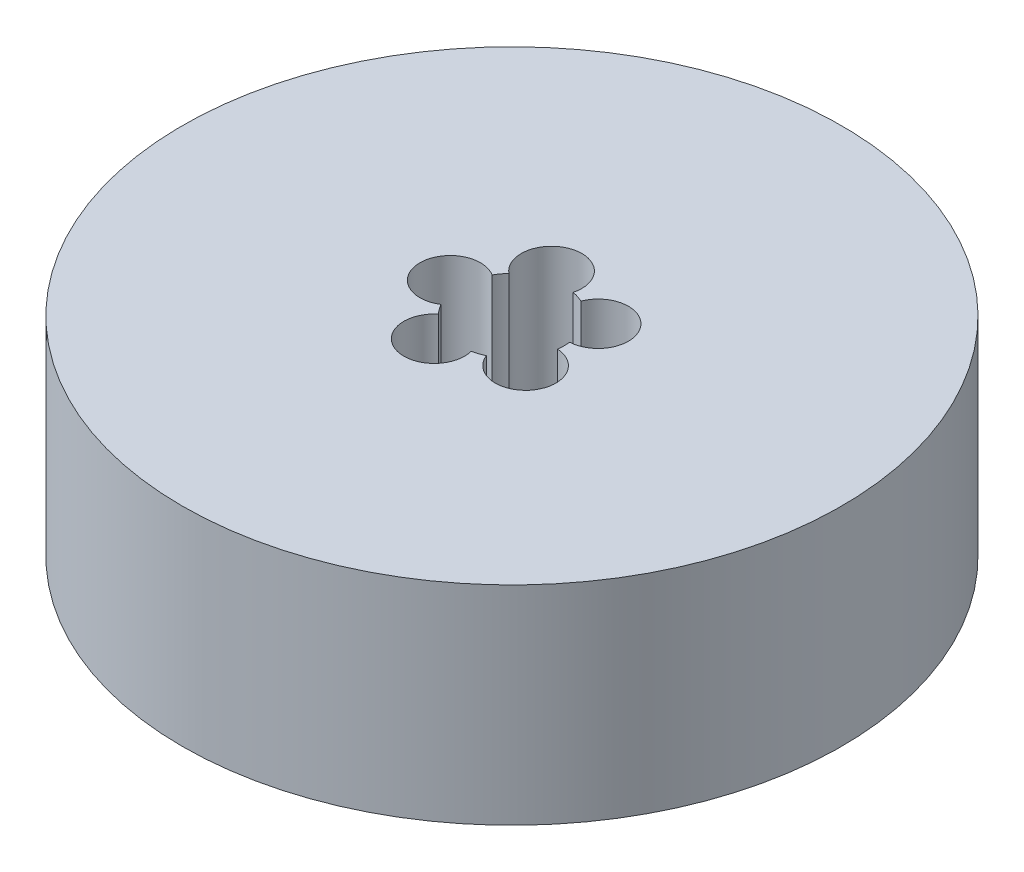
ISO-10303-21;
HEADER;
FILE_DESCRIPTION(('STEP AP214'),'2;1');
FILE_NAME('part.step','',(''),(''),'','','');
FILE_SCHEMA(('AUTOMOTIVE_DESIGN { 1 0 10303 214 1 1 1 1 }'));
ENDSEC;
DATA;
#1=APPLICATION_CONTEXT('core data for automotive mechanical design processes');
#2=APPLICATION_PROTOCOL_DEFINITION('international standard','automotive_design',2000,#1);
#3=PRODUCT_CONTEXT('',#1,'mechanical');
#4=PRODUCT('Part','Part','',(#3));
#5=PRODUCT_RELATED_PRODUCT_CATEGORY('part','',(#4));
#6=PRODUCT_DEFINITION_FORMATION('','',#4);
#7=PRODUCT_DEFINITION_CONTEXT('part definition',#1,'design');
#8=PRODUCT_DEFINITION('design','',#6,#7);
#9=PRODUCT_DEFINITION_SHAPE('','',#8);
#10=(LENGTH_UNIT() NAMED_UNIT(*) SI_UNIT(.MILLI.,.METRE.));
#11=(NAMED_UNIT(*) PLANE_ANGLE_UNIT() SI_UNIT($,.RADIAN.));
#12=(NAMED_UNIT(*) SI_UNIT($,.STERADIAN.) SOLID_ANGLE_UNIT());
#13=UNCERTAINTY_MEASURE_WITH_UNIT(LENGTH_MEASURE(1.E-05),#10,'distance_accuracy_value','');
#14=(GEOMETRIC_REPRESENTATION_CONTEXT(3) GLOBAL_UNCERTAINTY_ASSIGNED_CONTEXT((#13)) GLOBAL_UNIT_ASSIGNED_CONTEXT((#10,
#11,#12)) REPRESENTATION_CONTEXT('',''));
#15=CARTESIAN_POINT('',(0.,0.,0.));
#16=DIRECTION('',(0.,0.,1.));
#17=DIRECTION('',(1.,0.,0.));
#18=AXIS2_PLACEMENT_3D('',#15,#16,#17);
#19=CARTESIAN_POINT('',(0.,30.,0.));
#20=DIRECTION('',(0.,-1.,0.));
#21=DIRECTION('',(0.,0.,-1.));
#22=AXIS2_PLACEMENT_3D('',#19,#20,#21);
#23=CYLINDRICAL_SURFACE('',#22,47.5);
#24=CARTESIAN_POINT('',(0.,30.,0.));
#25=DIRECTION('',(0.,1.,0.));
#26=DIRECTION('',(0.,0.,1.));
#27=AXIS2_PLACEMENT_3D('',#24,#25,#26);
#28=CIRCLE('',#27,47.5);
#29=CARTESIAN_POINT('',(0.,30.,47.5));
#30=VERTEX_POINT('',#29);
#31=EDGE_CURVE('E157',#30,#30,#28,.T.);
#32=ORIENTED_EDGE('',*,*,#31,.F.);
#33=EDGE_LOOP('',(#32));
#34=FACE_BOUND('',#33,.T.);
#35=CARTESIAN_POINT('',(0.,0.,0.));
#36=DIRECTION('',(0.,1.,0.));
#37=DIRECTION('',(0.,0.,1.));
#38=AXIS2_PLACEMENT_3D('',#35,#36,#37);
#39=CIRCLE('',#38,47.5);
#40=CARTESIAN_POINT('',(0.,0.,47.5));
#41=VERTEX_POINT('',#40);
#42=EDGE_CURVE('E150',#41,#41,#39,.T.);
#43=ORIENTED_EDGE('',*,*,#42,.T.);
#44=EDGE_LOOP('',(#43));
#45=FACE_BOUND('',#44,.T.);
#46=ADVANCED_FACE('F39',(#34,#45),#23,.T.);
#47=CARTESIAN_POINT('',(0.,30.,0.));
#48=DIRECTION('',(0.,1.,0.));
#49=DIRECTION('',(0.,0.,1.));
#50=AXIS2_PLACEMENT_3D('',#47,#48,#49);
#51=PLANE('',#50);
#52=CARTESIAN_POINT('',(-2.74790330572732,30.,-8.45717676578609));
#53=DIRECTION('',(0.,1.,0.));
#54=DIRECTION('',(-0.95105651629515,0.,0.309016994374958));
#55=AXIS2_PLACEMENT_3D('',#52,#53,#54);
#56=CIRCLE('',#55,4.36889981615824);
#57=CARTESIAN_POINT('',(1.47908534895699,30.,-7.35270742859396));
#58=VERTEX_POINT('',#57);
#59=CARTESIAN_POINT('',(-5.51841817438616,30.,-5.07908070940052));
#60=VERTEX_POINT('',#59);
#61=EDGE_CURVE('E194',#58,#60,#56,.T.);
#62=ORIENTED_EDGE('',*,*,#61,.F.);
#63=CARTESIAN_POINT('',(0.,30.,0.));
#64=DIRECTION('',(0.,1.,0.));
#65=DIRECTION('',(0.,0.,1.));
#66=AXIS2_PLACEMENT_3D('',#63,#64,#65);
#67=CIRCLE('',#66,7.5);
#68=CARTESIAN_POINT('',(3.1252078075115,30.,-6.81784981939828));
#69=VERTEX_POINT('',#68);
#70=EDGE_CURVE('E147',#69,#58,#67,.T.);
#71=ORIENTED_EDGE('',*,*,#70,.F.);
#72=CARTESIAN_POINT('',(7.19410425219201,30.,-5.2268226901218));
#73=DIRECTION('',(0.,1.,0.));
#74=DIRECTION('',(-0.58778525229248,0.,-0.809016994374942));
#75=AXIS2_PLACEMENT_3D('',#72,#73,#74);
#76=CIRCLE('',#75,4.36889981615824);
#77=CARTESIAN_POINT('',(7.44990282133478,30.,-0.865417790820199));
#78=VERTEX_POINT('',#77);
#79=EDGE_CURVE('E254',#78,#69,#76,.T.);
#80=ORIENTED_EDGE('',*,*,#79,.F.);
#81=CARTESIAN_POINT('',(7.44990282133479,30.,0.865417790820091));
#82=VERTEX_POINT('',#81);
#83=EDGE_CURVE('E144',#82,#78,#67,.T.);
#84=ORIENTED_EDGE('',*,*,#83,.F.);
#85=CARTESIAN_POINT('',(7.19410425219209,30.,5.22682269012169));
#86=DIRECTION('',(0.,1.,0.));
#87=DIRECTION('',(0.587785252292469,0.,-0.809016994374951));
#88=AXIS2_PLACEMENT_3D('',#85,#86,#87);
#89=CIRCLE('',#88,4.36889981615824);
#90=CARTESIAN_POINT('',(3.1252078075116,30.,6.81784981939824));
#91=VERTEX_POINT('',#90);
#92=EDGE_CURVE('E141',#91,#82,#89,.T.);
#93=ORIENTED_EDGE('',*,*,#92,.F.);
#94=CARTESIAN_POINT('',(1.47908534895709,30.,7.35270742859394));
#95=VERTEX_POINT('',#94);
#96=EDGE_CURVE('E134',#95,#91,#67,.T.);
#97=ORIENTED_EDGE('',*,*,#96,.F.);
#98=CARTESIAN_POINT('',(-2.7479033057272,30.,8.45717676578613));
#99=DIRECTION('',(0.,1.,0.));
#100=DIRECTION('',(0.951056516295155,0.,0.309016994374945));
#101=AXIS2_PLACEMENT_3D('',#98,#99,#100);
#102=CIRCLE('',#101,4.36889981615824);
#103=CARTESIAN_POINT('',(-5.51841817438609,30.,5.0790807094006));
#104=VERTEX_POINT('',#103);
#105=EDGE_CURVE('E111',#104,#95,#102,.T.);
#106=ORIENTED_EDGE('',*,*,#105,.F.);
#107=CARTESIAN_POINT('',(-6.53577780341732,30.,3.67880530938476));
#108=VERTEX_POINT('',#107);
#109=EDGE_CURVE('E145',#108,#104,#67,.T.);
#110=ORIENTED_EDGE('',*,*,#109,.F.);
#111=CARTESIAN_POINT('',(-8.89240189292967,30.,0.));
#112=DIRECTION('',(0.,1.,0.));
#113=DIRECTION('',(0.,0.,1.));
#114=AXIS2_PLACEMENT_3D('',#111,#112,#113);
#115=CIRCLE('',#114,4.36889981615824);
#116=CARTESIAN_POINT('',(-6.53577780341732,30.,-3.67880530938476));
#117=VERTEX_POINT('',#116);
#118=EDGE_CURVE('E153',#117,#108,#115,.T.);
#119=ORIENTED_EDGE('',*,*,#118,.F.);
#120=EDGE_CURVE('E146',#60,#117,#67,.T.);
#121=ORIENTED_EDGE('',*,*,#120,.F.);
#122=EDGE_LOOP('',(#62,#71,#80,#84,#93,#97,#106,#110,#119,#121));
#123=FACE_BOUND('',#122,.T.);
#124=ORIENTED_EDGE('',*,*,#31,.T.);
#125=EDGE_LOOP('',(#124));
#126=FACE_BOUND('',#125,.T.);
#127=ADVANCED_FACE('F139',(#123,#126),#51,.T.);
#128=CARTESIAN_POINT('',(0.,0.,0.));
#129=DIRECTION('',(0.,1.,0.));
#130=DIRECTION('',(0.,0.,1.));
#131=AXIS2_PLACEMENT_3D('',#128,#129,#130);
#132=PLANE('',#131);
#133=CARTESIAN_POINT('',(0.,0.,0.));
#134=DIRECTION('',(0.,1.,0.));
#135=DIRECTION('',(0.,0.,1.));
#136=AXIS2_PLACEMENT_3D('',#133,#134,#135);
#137=CIRCLE('',#136,7.5);
#138=CARTESIAN_POINT('',(0.,0.,7.5));
#139=VERTEX_POINT('',#138);
#140=EDGE_CURVE('E154',#139,#139,#137,.T.);
#141=ORIENTED_EDGE('',*,*,#140,.T.);
#142=EDGE_LOOP('',(#141));
#143=FACE_BOUND('',#142,.T.);
#144=ORIENTED_EDGE('',*,*,#42,.F.);
#145=EDGE_LOOP('',(#144));
#146=FACE_BOUND('',#145,.T.);
#147=ADVANCED_FACE('F213',(#143,#146),#132,.F.);
#148=CARTESIAN_POINT('',(0.,30.,0.));
#149=DIRECTION('',(0.,-1.,0.));
#150=DIRECTION('',(0.,0.,-1.));
#151=AXIS2_PLACEMENT_3D('',#148,#149,#150);
#152=CYLINDRICAL_SURFACE('',#151,7.5);
#153=DIRECTION('',(0.,1.,0.));
#154=VECTOR('',#153,1.);
#155=CARTESIAN_POINT('',(1.47908534895699,16.5931715796083,-7.35270742859396));
#156=LINE('',#155,#154);
#157=CARTESIAN_POINT('',(1.47908534895699,3.18634315921669,-7.35270742859396));
#158=VERTEX_POINT('',#157);
#159=EDGE_CURVE('E11',#158,#58,#156,.T.);
#160=ORIENTED_EDGE('',*,*,#159,.F.);
#161=CARTESIAN_POINT('',(0.,3.18634315921669,0.));
#162=DIRECTION('',(0.,1.,0.));
#163=DIRECTION('',(0.,0.,1.));
#164=AXIS2_PLACEMENT_3D('',#161,#162,#163);
#165=CIRCLE('',#164,7.5);
#166=CARTESIAN_POINT('',(-5.51841817438616,3.18634315921669,-5.07908070940052));
#167=VERTEX_POINT('',#166);
#168=EDGE_CURVE('E189',#158,#167,#165,.T.);
#169=ORIENTED_EDGE('',*,*,#168,.T.);
#170=DIRECTION('',(0.,1.,0.));
#171=VECTOR('',#170,1.);
#172=CARTESIAN_POINT('',(-5.51841817438616,16.5931715796083,-5.07908070940052));
#173=LINE('',#172,#171);
#174=EDGE_CURVE('E46',#60,#167,#173,.F.);
#175=ORIENTED_EDGE('',*,*,#174,.F.);
#176=ORIENTED_EDGE('',*,*,#120,.T.);
#177=DIRECTION('',(0.,1.,0.));
#178=VECTOR('',#177,1.);
#179=CARTESIAN_POINT('',(-6.53577780341732,16.5931715796083,-3.67880530938476));
#180=LINE('',#179,#178);
#181=CARTESIAN_POINT('',(-6.53577780341732,3.18634315921669,-3.67880530938476));
#182=VERTEX_POINT('',#181);
#183=EDGE_CURVE('E168',#182,#117,#180,.T.);
#184=ORIENTED_EDGE('',*,*,#183,.F.);
#185=CARTESIAN_POINT('',(0.,3.18634315921669,0.));
#186=DIRECTION('',(0.,1.,0.));
#187=DIRECTION('',(0.,0.,1.));
#188=AXIS2_PLACEMENT_3D('',#185,#186,#187);
#189=CIRCLE('',#188,7.5);
#190=CARTESIAN_POINT('',(-6.53577780341732,3.18634315921669,3.67880530938476));
#191=VERTEX_POINT('',#190);
#192=EDGE_CURVE('E165',#182,#191,#189,.T.);
#193=ORIENTED_EDGE('',*,*,#192,.T.);
#194=DIRECTION('',(0.,1.,0.));
#195=VECTOR('',#194,1.);
#196=CARTESIAN_POINT('',(-6.53577780341732,16.5931715796083,3.67880530938476));
#197=LINE('',#196,#195);
#198=EDGE_CURVE('E170',#108,#191,#197,.F.);
#199=ORIENTED_EDGE('',*,*,#198,.F.);
#200=ORIENTED_EDGE('',*,*,#109,.T.);
#201=DIRECTION('',(0.,1.,0.));
#202=VECTOR('',#201,1.);
#203=CARTESIAN_POINT('',(-5.51841817438609,16.5931715796083,5.0790807094006));
#204=LINE('',#203,#202);
#205=CARTESIAN_POINT('',(-5.51841817438609,3.18634315921669,5.0790807094006));
#206=VERTEX_POINT('',#205);
#207=EDGE_CURVE('E121',#206,#104,#204,.T.);
#208=ORIENTED_EDGE('',*,*,#207,.F.);
#209=CARTESIAN_POINT('',(0.,3.18634315921669,0.));
#210=DIRECTION('',(0.,1.,0.));
#211=DIRECTION('',(0.,0.,1.));
#212=AXIS2_PLACEMENT_3D('',#209,#210,#211);
#213=CIRCLE('',#212,7.5);
#214=CARTESIAN_POINT('',(1.47908534895709,3.18634315921669,7.35270742859394));
#215=VERTEX_POINT('',#214);
#216=EDGE_CURVE('E136',#206,#215,#213,.T.);
#217=ORIENTED_EDGE('',*,*,#216,.T.);
#218=DIRECTION('',(0.,1.,0.));
#219=VECTOR('',#218,1.);
#220=CARTESIAN_POINT('',(1.47908534895709,16.5931715796083,7.35270742859394));
#221=LINE('',#220,#219);
#222=EDGE_CURVE('E117',#95,#215,#221,.F.);
#223=ORIENTED_EDGE('',*,*,#222,.F.);
#224=ORIENTED_EDGE('',*,*,#96,.T.);
#225=DIRECTION('',(0.,1.,0.));
#226=VECTOR('',#225,1.);
#227=CARTESIAN_POINT('',(3.1252078075116,16.5931715796083,6.81784981939823));
#228=LINE('',#227,#226);
#229=CARTESIAN_POINT('',(3.1252078075116,3.18634315921669,6.81784981939824));
#230=VERTEX_POINT('',#229);
#231=EDGE_CURVE('E182',#230,#91,#228,.T.);
#232=ORIENTED_EDGE('',*,*,#231,.F.);
#233=CARTESIAN_POINT('',(0.,3.18634315921669,0.));
#234=DIRECTION('',(0.,1.,0.));
#235=DIRECTION('',(0.,0.,1.));
#236=AXIS2_PLACEMENT_3D('',#233,#234,#235);
#237=CIRCLE('',#236,7.5);
#238=CARTESIAN_POINT('',(7.44990282133479,3.18634315921669,0.865417790820091));
#239=VERTEX_POINT('',#238);
#240=EDGE_CURVE('E174',#230,#239,#237,.T.);
#241=ORIENTED_EDGE('',*,*,#240,.T.);
#242=DIRECTION('',(0.,1.,0.));
#243=VECTOR('',#242,1.);
#244=CARTESIAN_POINT('',(7.44990282133479,16.5931715796083,0.865417790820091));
#245=LINE('',#244,#243);
#246=EDGE_CURVE('E177',#82,#239,#245,.F.);
#247=ORIENTED_EDGE('',*,*,#246,.F.);
#248=ORIENTED_EDGE('',*,*,#83,.T.);
#249=DIRECTION('',(0.,1.,0.));
#250=VECTOR('',#249,1.);
#251=CARTESIAN_POINT('',(7.44990282133478,16.5931715796083,-0.865417790820199));
#252=LINE('',#251,#250);
#253=CARTESIAN_POINT('',(7.44990282133478,3.18634315921669,-0.865417790820199));
#254=VERTEX_POINT('',#253);
#255=EDGE_CURVE('E187',#254,#78,#252,.T.);
#256=ORIENTED_EDGE('',*,*,#255,.F.);
#257=CARTESIAN_POINT('',(0.,3.18634315921669,0.));
#258=DIRECTION('',(0.,1.,0.));
#259=DIRECTION('',(0.,0.,1.));
#260=AXIS2_PLACEMENT_3D('',#257,#258,#259);
#261=CIRCLE('',#260,7.5);
#262=CARTESIAN_POINT('',(3.1252078075115,3.18634315921669,-6.81784981939828));
#263=VERTEX_POINT('',#262);
#264=EDGE_CURVE('E181',#254,#263,#261,.T.);
#265=ORIENTED_EDGE('',*,*,#264,.T.);
#266=DIRECTION('',(0.,1.,0.));
#267=VECTOR('',#266,1.);
#268=CARTESIAN_POINT('',(3.1252078075115,16.5931715796083,-6.81784981939828));
#269=LINE('',#268,#267);
#270=EDGE_CURVE('E186',#69,#263,#269,.F.);
#271=ORIENTED_EDGE('',*,*,#270,.F.);
#272=ORIENTED_EDGE('',*,*,#70,.T.);
#273=EDGE_LOOP('',(#160,#169,#175,#176,#184,#193,#199,#200,#208,#217,#223,#224,#232,#241,#247,
#248,#256,#265,#271,#272));
#274=FACE_BOUND('',#273,.T.);
#275=ORIENTED_EDGE('',*,*,#140,.F.);
#276=EDGE_LOOP('',(#275));
#277=FACE_BOUND('',#276,.T.);
#278=ADVANCED_FACE('F135',(#274,#277),#152,.F.);
#279=CARTESIAN_POINT('',(-8.89240189292967,3.18634315921669,0.));
#280=DIRECTION('',(0.,1.,0.));
#281=DIRECTION('',(0.,0.,1.));
#282=AXIS2_PLACEMENT_3D('',#279,#280,#281);
#283=CYLINDRICAL_SURFACE('',#282,4.36889981615824);
#284=ORIENTED_EDGE('',*,*,#183,.T.);
#285=ORIENTED_EDGE('',*,*,#118,.T.);
#286=ORIENTED_EDGE('',*,*,#198,.T.);
#287=CARTESIAN_POINT('',(-8.89240189292967,3.18634315921669,0.));
#288=DIRECTION('',(0.,1.,0.));
#289=DIRECTION('',(0.,0.,1.));
#290=AXIS2_PLACEMENT_3D('',#287,#288,#289);
#291=CIRCLE('',#290,4.36889981615824);
#292=EDGE_CURVE('E158',#182,#191,#291,.T.);
#293=ORIENTED_EDGE('',*,*,#292,.F.);
#294=EDGE_LOOP('',(#284,#285,#286,#293));
#295=FACE_BOUND('',#294,.T.);
#296=ADVANCED_FACE('F221',(#295),#283,.F.);
#297=CARTESIAN_POINT('',(-8.89240189292967,3.18634315921669,0.));
#298=DIRECTION('',(0.,1.,0.));
#299=DIRECTION('',(0.,0.,1.));
#300=AXIS2_PLACEMENT_3D('',#297,#298,#299);
#301=PLANE('',#300);
#302=ORIENTED_EDGE('',*,*,#292,.T.);
#303=ORIENTED_EDGE('',*,*,#192,.F.);
#304=EDGE_LOOP('',(#302,#303));
#305=FACE_BOUND('',#304,.T.);
#306=ADVANCED_FACE('F227',(#305),#301,.T.);
#307=CARTESIAN_POINT('',(-2.7479033057272,3.18634315921669,8.45717676578613));
#308=DIRECTION('',(0.,1.,0.));
#309=DIRECTION('',(0.,0.,1.));
#310=AXIS2_PLACEMENT_3D('',#307,#308,#309);
#311=CYLINDRICAL_SURFACE('',#310,4.36889981615824);
#312=ORIENTED_EDGE('',*,*,#207,.T.);
#313=ORIENTED_EDGE('',*,*,#105,.T.);
#314=ORIENTED_EDGE('',*,*,#222,.T.);
#315=CARTESIAN_POINT('',(-2.7479033057272,3.18634315921669,8.45717676578613));
#316=DIRECTION('',(0.,1.,0.));
#317=DIRECTION('',(0.951056516295155,0.,0.309016994374945));
#318=AXIS2_PLACEMENT_3D('',#315,#316,#317);
#319=CIRCLE('',#318,4.36889981615824);
#320=EDGE_CURVE('E127',#206,#215,#319,.T.);
#321=ORIENTED_EDGE('',*,*,#320,.F.);
#322=EDGE_LOOP('',(#312,#313,#314,#321));
#323=FACE_BOUND('',#322,.T.);
#324=ADVANCED_FACE('F116',(#323),#311,.F.);
#325=CARTESIAN_POINT('',(-2.7479033057272,3.18634315921669,8.45717676578613));
#326=DIRECTION('',(0.,1.,0.));
#327=DIRECTION('',(0.951056516295155,0.,0.309016994374945));
#328=AXIS2_PLACEMENT_3D('',#325,#326,#327);
#329=PLANE('',#328);
#330=ORIENTED_EDGE('',*,*,#320,.T.);
#331=ORIENTED_EDGE('',*,*,#216,.F.);
#332=EDGE_LOOP('',(#330,#331));
#333=FACE_BOUND('',#332,.T.);
#334=ADVANCED_FACE('F234',(#333),#329,.T.);
#335=CARTESIAN_POINT('',(7.19410425219209,3.18634315921669,5.22682269012169));
#336=DIRECTION('',(0.,1.,0.));
#337=DIRECTION('',(0.,0.,1.));
#338=AXIS2_PLACEMENT_3D('',#335,#336,#337);
#339=CYLINDRICAL_SURFACE('',#338,4.36889981615824);
#340=ORIENTED_EDGE('',*,*,#231,.T.);
#341=ORIENTED_EDGE('',*,*,#92,.T.);
#342=ORIENTED_EDGE('',*,*,#246,.T.);
#343=CARTESIAN_POINT('',(7.19410425219209,3.18634315921669,5.22682269012169));
#344=DIRECTION('',(0.,1.,0.));
#345=DIRECTION('',(0.587785252292469,0.,-0.809016994374951));
#346=AXIS2_PLACEMENT_3D('',#343,#344,#345);
#347=CIRCLE('',#346,4.36889981615824);
#348=EDGE_CURVE('E130',#230,#239,#347,.T.);
#349=ORIENTED_EDGE('',*,*,#348,.F.);
#350=EDGE_LOOP('',(#340,#341,#342,#349));
#351=FACE_BOUND('',#350,.T.);
#352=ADVANCED_FACE('F240',(#351),#339,.F.);
#353=CARTESIAN_POINT('',(7.19410425219209,3.18634315921669,5.22682269012169));
#354=DIRECTION('',(0.,1.,0.));
#355=DIRECTION('',(0.587785252292469,0.,-0.809016994374951));
#356=AXIS2_PLACEMENT_3D('',#353,#354,#355);
#357=PLANE('',#356);
#358=ORIENTED_EDGE('',*,*,#348,.T.);
#359=ORIENTED_EDGE('',*,*,#240,.F.);
#360=EDGE_LOOP('',(#358,#359));
#361=FACE_BOUND('',#360,.T.);
#362=ADVANCED_FACE('F245',(#361),#357,.T.);
#363=CARTESIAN_POINT('',(7.19410425219201,3.18634315921669,-5.2268226901218));
#364=DIRECTION('',(0.,1.,0.));
#365=DIRECTION('',(0.,0.,1.));
#366=AXIS2_PLACEMENT_3D('',#363,#364,#365);
#367=CYLINDRICAL_SURFACE('',#366,4.36889981615824);
#368=ORIENTED_EDGE('',*,*,#255,.T.);
#369=ORIENTED_EDGE('',*,*,#79,.T.);
#370=ORIENTED_EDGE('',*,*,#270,.T.);
#371=CARTESIAN_POINT('',(7.19410425219201,3.18634315921669,-5.2268226901218));
#372=DIRECTION('',(0.,1.,0.));
#373=DIRECTION('',(-0.58778525229248,0.,-0.809016994374942));
#374=AXIS2_PLACEMENT_3D('',#371,#372,#373);
#375=CIRCLE('',#374,4.36889981615824);
#376=EDGE_CURVE('E56',#254,#263,#375,.T.);
#377=ORIENTED_EDGE('',*,*,#376,.F.);
#378=EDGE_LOOP('',(#368,#369,#370,#377));
#379=FACE_BOUND('',#378,.T.);
#380=ADVANCED_FACE('F266',(#379),#367,.F.);
#381=CARTESIAN_POINT('',(7.19410425219201,3.18634315921669,-5.2268226901218));
#382=DIRECTION('',(0.,1.,0.));
#383=DIRECTION('',(-0.58778525229248,0.,-0.809016994374942));
#384=AXIS2_PLACEMENT_3D('',#381,#382,#383);
#385=PLANE('',#384);
#386=ORIENTED_EDGE('',*,*,#376,.T.);
#387=ORIENTED_EDGE('',*,*,#264,.F.);
#388=EDGE_LOOP('',(#386,#387));
#389=FACE_BOUND('',#388,.T.);
#390=ADVANCED_FACE('F204',(#389),#385,.T.);
#391=CARTESIAN_POINT('',(-2.74790330572732,3.18634315921669,-8.45717676578609));
#392=DIRECTION('',(0.,1.,0.));
#393=DIRECTION('',(0.,0.,1.));
#394=AXIS2_PLACEMENT_3D('',#391,#392,#393);
#395=CYLINDRICAL_SURFACE('',#394,4.36889981615824);
#396=ORIENTED_EDGE('',*,*,#159,.T.);
#397=ORIENTED_EDGE('',*,*,#61,.T.);
#398=ORIENTED_EDGE('',*,*,#174,.T.);
#399=CARTESIAN_POINT('',(-2.74790330572732,3.18634315921669,-8.45717676578609));
#400=DIRECTION('',(0.,1.,0.));
#401=DIRECTION('',(-0.95105651629515,0.,0.309016994374958));
#402=AXIS2_PLACEMENT_3D('',#399,#400,#401);
#403=CIRCLE('',#402,4.36889981615824);
#404=EDGE_CURVE('E55',#158,#167,#403,.T.);
#405=ORIENTED_EDGE('',*,*,#404,.F.);
#406=EDGE_LOOP('',(#396,#397,#398,#405));
#407=FACE_BOUND('',#406,.T.);
#408=ADVANCED_FACE('F193',(#407),#395,.F.);
#409=CARTESIAN_POINT('',(-2.74790330572732,3.18634315921669,-8.45717676578609));
#410=DIRECTION('',(0.,1.,0.));
#411=DIRECTION('',(-0.95105651629515,0.,0.309016994374958));
#412=AXIS2_PLACEMENT_3D('',#409,#410,#411);
#413=PLANE('',#412);
#414=ORIENTED_EDGE('',*,*,#404,.T.);
#415=ORIENTED_EDGE('',*,*,#168,.F.);
#416=EDGE_LOOP('',(#414,#415));
#417=FACE_BOUND('',#416,.T.);
#418=ADVANCED_FACE('F196',(#417),#413,.T.);
#419=CLOSED_SHELL('',(#46,#127,#147,#278,#296,#306,#324,#334,#352,#362,#380,#390,#408,#418));
#420=MANIFOLD_SOLID_BREP('B2',#419);
#421=ADVANCED_BREP_SHAPE_REPRESENTATION('',(#18,#420),#14);
#422=SHAPE_DEFINITION_REPRESENTATION(#9,#421);
ENDSEC;
END-ISO-10303-21;
